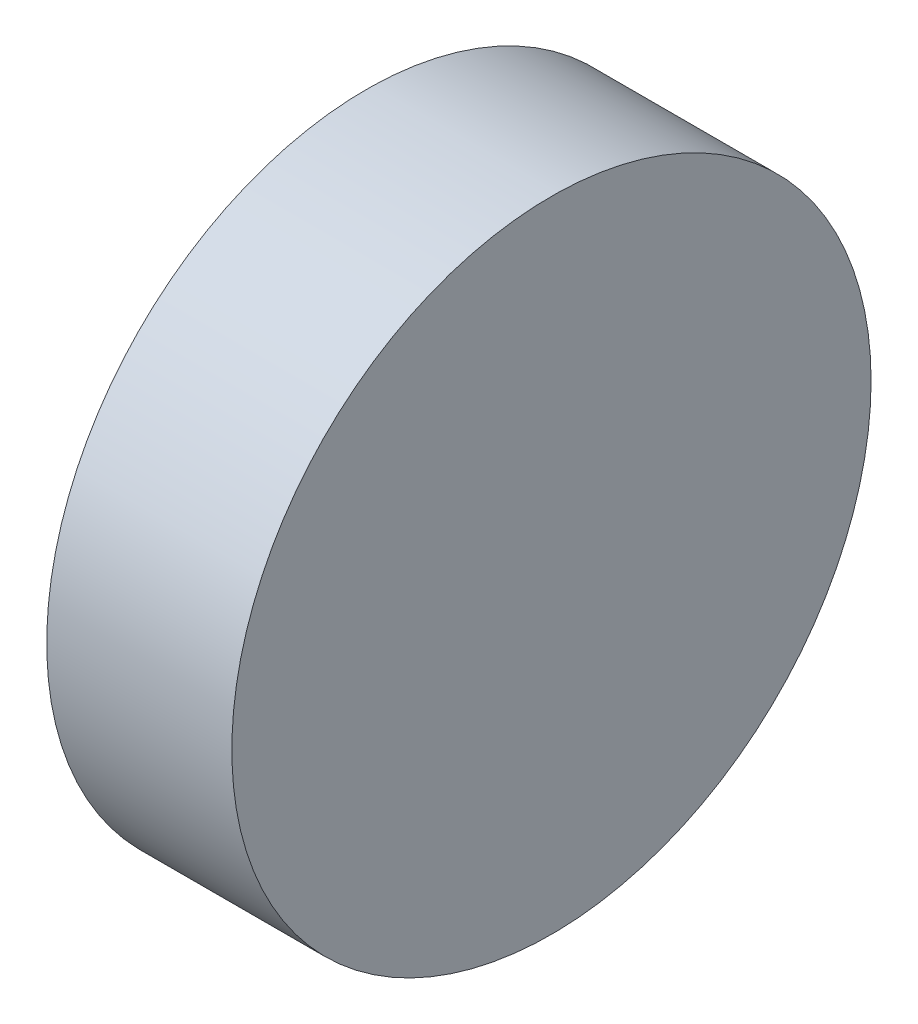
ISO-10303-21;
HEADER;
FILE_DESCRIPTION(('STEP AP214'),'2;1');
FILE_NAME('part.step','',(''),(''),'','','');
FILE_SCHEMA(('AUTOMOTIVE_DESIGN { 1 0 10303 214 1 1 1 1 }'));
ENDSEC;
DATA;
#1=APPLICATION_CONTEXT('core data for automotive mechanical design processes');
#2=APPLICATION_PROTOCOL_DEFINITION('international standard','automotive_design',2000,#1);
#3=PRODUCT_CONTEXT('',#1,'mechanical');
#4=PRODUCT('Part','Part','',(#3));
#5=PRODUCT_RELATED_PRODUCT_CATEGORY('part','',(#4));
#6=PRODUCT_DEFINITION_FORMATION('','',#4);
#7=PRODUCT_DEFINITION_CONTEXT('part definition',#1,'design');
#8=PRODUCT_DEFINITION('design','',#6,#7);
#9=PRODUCT_DEFINITION_SHAPE('','',#8);
#10=(LENGTH_UNIT() NAMED_UNIT(*) SI_UNIT(.MILLI.,.METRE.));
#11=(NAMED_UNIT(*) PLANE_ANGLE_UNIT() SI_UNIT($,.RADIAN.));
#12=(NAMED_UNIT(*) SI_UNIT($,.STERADIAN.) SOLID_ANGLE_UNIT());
#13=UNCERTAINTY_MEASURE_WITH_UNIT(LENGTH_MEASURE(1.E-05),#10,'distance_accuracy_value','');
#14=(GEOMETRIC_REPRESENTATION_CONTEXT(3) GLOBAL_UNCERTAINTY_ASSIGNED_CONTEXT((#13)) GLOBAL_UNIT_ASSIGNED_CONTEXT((#10,
#11,#12)) REPRESENTATION_CONTEXT('',''));
#15=CARTESIAN_POINT('',(0.,0.,0.));
#16=DIRECTION('',(0.,0.,1.));
#17=DIRECTION('',(1.,0.,0.));
#18=AXIS2_PLACEMENT_3D('',#15,#16,#17);
#19=CARTESIAN_POINT('',(0.,0.,0.));
#20=DIRECTION('',(-1.,0.,0.));
#21=DIRECTION('',(0.,0.,1.));
#22=AXIS2_PLACEMENT_3D('',#19,#20,#21);
#23=PLANE('',#22);
#24=CARTESIAN_POINT('',(0.,0.,0.));
#25=DIRECTION('',(-1.,0.,0.));
#26=DIRECTION('',(0.,0.,1.));
#27=AXIS2_PLACEMENT_3D('',#24,#25,#26);
#28=CIRCLE('',#27,60.4920507319896);
#29=CARTESIAN_POINT('',(0.,0.,60.4920507319896));
#30=VERTEX_POINT('',#29);
#31=EDGE_CURVE('E49',#30,#30,#28,.F.);
#32=ORIENTED_EDGE('',*,*,#31,.T.);
#33=EDGE_LOOP('',(#32));
#34=FACE_BOUND('',#33,.T.);
#35=CARTESIAN_POINT('',(0.,0.,0.));
#36=DIRECTION('',(1.,0.,0.));
#37=DIRECTION('',(0.,0.,-1.));
#38=AXIS2_PLACEMENT_3D('',#35,#36,#37);
#39=CIRCLE('',#38,60.9920507319896);
#40=CARTESIAN_POINT('',(0.,0.,-60.9920507319896));
#41=VERTEX_POINT('',#40);
#42=EDGE_CURVE('E10',#41,#41,#39,.T.);
#43=ORIENTED_EDGE('',*,*,#42,.F.);
#44=EDGE_LOOP('',(#43));
#45=FACE_BOUND('',#44,.T.);
#46=ADVANCED_FACE('F37',(#34,#45),#23,.T.);
#47=CARTESIAN_POINT('',(35.3207029917727,0.,0.));
#48=DIRECTION('',(1.,0.,0.));
#49=DIRECTION('',(0.,0.,-1.));
#50=AXIS2_PLACEMENT_3D('',#47,#48,#49);
#51=CYLINDRICAL_SURFACE('',#50,60.9920507319896);
#52=ORIENTED_EDGE('',*,*,#42,.T.);
#53=EDGE_LOOP('',(#52));
#54=FACE_BOUND('',#53,.T.);
#55=CARTESIAN_POINT('',(35.3207029917727,0.,0.));
#56=DIRECTION('',(1.,0.,0.));
#57=DIRECTION('',(0.,0.,-1.));
#58=AXIS2_PLACEMENT_3D('',#55,#56,#57);
#59=CIRCLE('',#58,60.9920507319896);
#60=CARTESIAN_POINT('',(35.3207029917727,0.,-60.9920507319896));
#61=VERTEX_POINT('',#60);
#62=EDGE_CURVE('E44',#61,#61,#59,.T.);
#63=ORIENTED_EDGE('',*,*,#62,.F.);
#64=EDGE_LOOP('',(#63));
#65=FACE_BOUND('',#64,.T.);
#66=ADVANCED_FACE('F74',(#54,#65),#51,.T.);
#67=CARTESIAN_POINT('',(35.3207029917727,60.9920507319896,0.));
#68=DIRECTION('',(1.,0.,0.));
#69=DIRECTION('',(0.,0.,-1.));
#70=AXIS2_PLACEMENT_3D('',#67,#68,#69);
#71=PLANE('',#70);
#72=ORIENTED_EDGE('',*,*,#62,.T.);
#73=EDGE_LOOP('',(#72));
#74=FACE_BOUND('',#73,.T.);
#75=ADVANCED_FACE('F69',(#74),#71,.T.);
#76=CARTESIAN_POINT('',(35.3207029917727,0.,0.));
#77=DIRECTION('',(1.,0.,0.));
#78=DIRECTION('',(0.,0.,-1.));
#79=AXIS2_PLACEMENT_3D('',#76,#77,#78);
#80=CYLINDRICAL_SURFACE('',#79,60.4920507319896);
#81=ORIENTED_EDGE('',*,*,#31,.F.);
#82=EDGE_LOOP('',(#81));
#83=FACE_BOUND('',#82,.T.);
#84=CARTESIAN_POINT('',(34.8207029917727,0.,0.));
#85=DIRECTION('',(1.,0.,0.));
#86=DIRECTION('',(0.,0.,-1.));
#87=AXIS2_PLACEMENT_3D('',#84,#85,#86);
#88=CIRCLE('',#87,60.4920507319896);
#89=CARTESIAN_POINT('',(34.8207029917727,0.,-60.4920507319896));
#90=VERTEX_POINT('',#89);
#91=EDGE_CURVE('E54',#90,#90,#88,.T.);
#92=ORIENTED_EDGE('',*,*,#91,.T.);
#93=EDGE_LOOP('',(#92));
#94=FACE_BOUND('',#93,.T.);
#95=ADVANCED_FACE('F61',(#83,#94),#80,.F.);
#96=CARTESIAN_POINT('',(34.8207029917727,60.9920507319896,0.));
#97=DIRECTION('',(1.,0.,0.));
#98=DIRECTION('',(0.,0.,-1.));
#99=AXIS2_PLACEMENT_3D('',#96,#97,#98);
#100=PLANE('',#99);
#101=ORIENTED_EDGE('',*,*,#91,.F.);
#102=EDGE_LOOP('',(#101));
#103=FACE_BOUND('',#102,.T.);
#104=ADVANCED_FACE('F63',(#103),#100,.F.);
#105=CLOSED_SHELL('',(#46,#66,#75,#95,#104));
#106=MANIFOLD_SOLID_BREP('B2',#105);
#107=ADVANCED_BREP_SHAPE_REPRESENTATION('',(#18,#106),#14);
#108=SHAPE_DEFINITION_REPRESENTATION(#9,#107);
ENDSEC;
END-ISO-10303-21;
